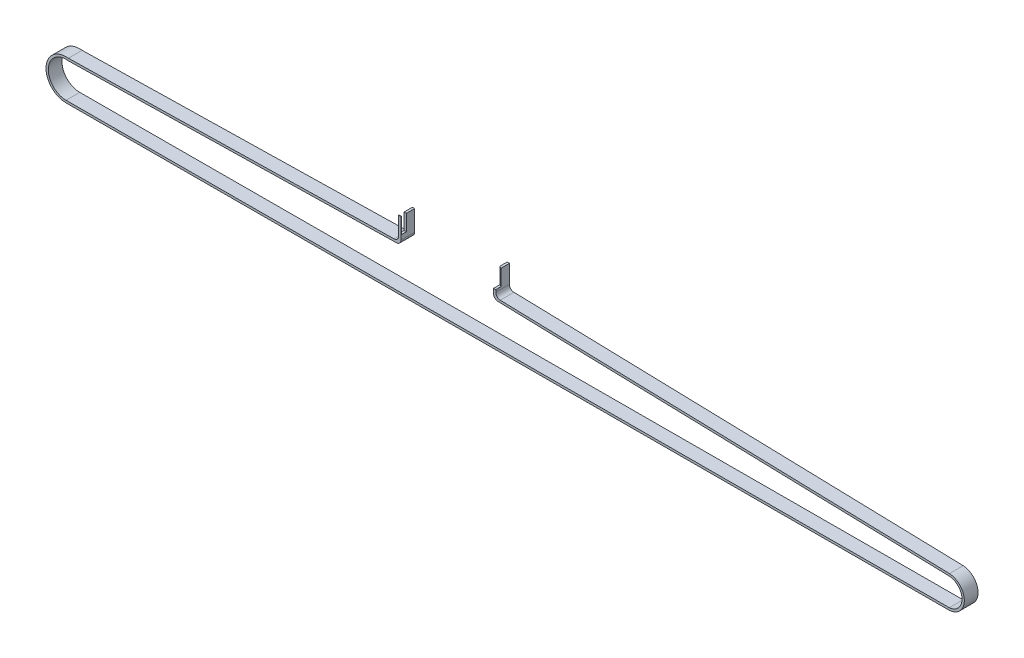
ISO-10303-21;
HEADER;
FILE_DESCRIPTION(('STEP AP214'),'2;1');
FILE_NAME('part.step','',(''),(''),'','','');
FILE_SCHEMA(('AUTOMOTIVE_DESIGN { 1 0 10303 214 1 1 1 1 }'));
ENDSEC;
DATA;
#1=APPLICATION_CONTEXT('core data for automotive mechanical design processes');
#2=APPLICATION_PROTOCOL_DEFINITION('international standard','automotive_design',2000,#1);
#3=PRODUCT_CONTEXT('',#1,'mechanical');
#4=PRODUCT('Part','Part','',(#3));
#5=PRODUCT_RELATED_PRODUCT_CATEGORY('part','',(#4));
#6=PRODUCT_DEFINITION_FORMATION('','',#4);
#7=PRODUCT_DEFINITION_CONTEXT('part definition',#1,'design');
#8=PRODUCT_DEFINITION('design','',#6,#7);
#9=PRODUCT_DEFINITION_SHAPE('','',#8);
#10=(LENGTH_UNIT() NAMED_UNIT(*) SI_UNIT(.MILLI.,.METRE.));
#11=(NAMED_UNIT(*) PLANE_ANGLE_UNIT() SI_UNIT($,.RADIAN.));
#12=(NAMED_UNIT(*) SI_UNIT($,.STERADIAN.) SOLID_ANGLE_UNIT());
#13=UNCERTAINTY_MEASURE_WITH_UNIT(LENGTH_MEASURE(1.E-05),#10,'distance_accuracy_value','');
#14=(GEOMETRIC_REPRESENTATION_CONTEXT(3) GLOBAL_UNCERTAINTY_ASSIGNED_CONTEXT((#13)) GLOBAL_UNIT_ASSIGNED_CONTEXT((#10,
#11,#12)) REPRESENTATION_CONTEXT('',''));
#15=CARTESIAN_POINT('',(0.,0.,0.));
#16=DIRECTION('',(0.,0.,1.));
#17=DIRECTION('',(1.,0.,0.));
#18=AXIS2_PLACEMENT_3D('',#15,#16,#17);
#19=CARTESIAN_POINT('',(-77.6123917073383,-109.1707684477,6.56356693467296));
#20=DIRECTION('',(0.,1.,0.));
#21=DIRECTION('',(0.,0.,1.));
#22=AXIS2_PLACEMENT_3D('',#19,#20,#21);
#23=PLANE('',#22);
#24=CARTESIAN_POINT('',(-76.3043909029961,-109.1707684477,2.20000000000011));
#25=DIRECTION('',(0.,1.,0.));
#26=DIRECTION('',(0.,0.,1.));
#27=AXIS2_PLACEMENT_3D('',#24,#25,#26);
#28=CIRCLE('',#27,2.);
#29=CARTESIAN_POINT('',(-76.6123917073383,-109.1707684477,4.17614156996025));
#30=VERTEX_POINT('',#29);
#31=CARTESIAN_POINT('',(-77.6123917073383,-109.1707684477,3.71298839910964));
#32=VERTEX_POINT('',#31);
#33=EDGE_CURVE('E21',#30,#32,#28,.F.);
#34=ORIENTED_EDGE('',*,*,#33,.F.);
#35=DIRECTION('',(0.,0.,-1.));
#36=VECTOR('',#35,1.);
#37=CARTESIAN_POINT('',(-76.6123917073383,-109.1707684477,6.56356693467296));
#38=LINE('',#37,#36);
#39=CARTESIAN_POINT('',(-76.6123917073383,-109.1707684477,0.563566934672959));
#40=VERTEX_POINT('',#39);
#41=EDGE_CURVE('E187',#40,#30,#38,.F.);
#42=ORIENTED_EDGE('',*,*,#41,.F.);
#43=DIRECTION('',(1.,0.,0.));
#44=VECTOR('',#43,1.);
#45=CARTESIAN_POINT('',(-77.6123917073383,-109.1707684477,0.563566934672959));
#46=LINE('',#45,#44);
#47=CARTESIAN_POINT('',(-77.4542112466602,-109.1707684477,0.563566934672959));
#48=VERTEX_POINT('',#47);
#49=EDGE_CURVE('E194',#40,#48,#46,.F.);
#50=ORIENTED_EDGE('',*,*,#49,.T.);
#51=CARTESIAN_POINT('',(-76.3043909029961,-109.1707684477,2.20000000000011));
#52=DIRECTION('',(0.,1.,0.));
#53=DIRECTION('',(0.,0.,1.));
#54=AXIS2_PLACEMENT_3D('',#51,#52,#53);
#55=CIRCLE('',#54,2.);
#56=CARTESIAN_POINT('',(-77.6123917073383,-109.1707684477,0.687011600890581));
#57=VERTEX_POINT('',#56);
#58=EDGE_CURVE('E208',#57,#48,#55,.F.);
#59=ORIENTED_EDGE('',*,*,#58,.F.);
#60=DIRECTION('',(0.,0.,-1.));
#61=VECTOR('',#60,1.);
#62=CARTESIAN_POINT('',(-77.6123917073383,-109.1707684477,6.56356693467296));
#63=LINE('',#62,#61);
#64=EDGE_CURVE('E190',#57,#32,#63,.F.);
#65=ORIENTED_EDGE('',*,*,#64,.T.);
#66=EDGE_LOOP('',(#34,#42,#50,#59,#65));
#67=FACE_BOUND('',#66,.T.);
#68=ADVANCED_FACE('F18',(#67),#23,.T.);
#69=CARTESIAN_POINT('',(-76.3043909029961,-116.170768447701,2.20000000000011));
#70=DIRECTION('',(0.,1.,0.));
#71=DIRECTION('',(0.,0.,1.));
#72=AXIS2_PLACEMENT_3D('',#69,#70,#71);
#73=CYLINDRICAL_SURFACE('',#72,2.);
#74=CARTESIAN_POINT('',(-76.3043909029961,-116.170768447701,2.20000000000011));
#75=DIRECTION('',(0.,1.,0.));
#76=DIRECTION('',(0.,0.,1.));
#77=AXIS2_PLACEMENT_3D('',#74,#75,#76);
#78=CIRCLE('',#77,2.);
#79=CARTESIAN_POINT('',(-76.6123917073383,-116.170768447701,4.17614156996025));
#80=VERTEX_POINT('',#79);
#81=CARTESIAN_POINT('',(-77.6123917073383,-116.170768447701,3.71298839910964));
#82=VERTEX_POINT('',#81);
#83=EDGE_CURVE('E193',#80,#82,#78,.F.);
#84=ORIENTED_EDGE('',*,*,#83,.F.);
#85=DIRECTION('',(0.,1.,0.));
#86=VECTOR('',#85,1.);
#87=CARTESIAN_POINT('',(-76.6123917073383,-120.096434525264,4.17614156996025));
#88=LINE('',#87,#86);
#89=EDGE_CURVE('E196',#30,#80,#88,.F.);
#90=ORIENTED_EDGE('',*,*,#89,.F.);
#91=ORIENTED_EDGE('',*,*,#33,.T.);
#92=DIRECTION('',(0.,1.,0.));
#93=VECTOR('',#92,1.);
#94=CARTESIAN_POINT('',(-77.6123917073383,-120.096434525264,3.71298839910964));
#95=LINE('',#94,#93);
#96=EDGE_CURVE('E269',#32,#82,#95,.F.);
#97=ORIENTED_EDGE('',*,*,#96,.T.);
#98=EDGE_LOOP('',(#84,#90,#91,#97));
#99=FACE_BOUND('',#98,.T.);
#100=ADVANCED_FACE('F197',(#99),#73,.T.);
#101=CARTESIAN_POINT('',(-76.3043909029961,-116.170768447701,2.20000000000011));
#102=DIRECTION('',(0.,1.,0.));
#103=DIRECTION('',(0.,0.,1.));
#104=AXIS2_PLACEMENT_3D('',#101,#102,#103);
#105=PLANE('',#104);
#106=DIRECTION('',(1.,0.,0.));
#107=VECTOR('',#106,1.);
#108=CARTESIAN_POINT('',(-76.3043909029961,-116.170768447701,6.56356693467296));
#109=LINE('',#108,#107);
#110=CARTESIAN_POINT('',(-77.6123917073383,-116.170768447701,6.56356693467296));
#111=VERTEX_POINT('',#110);
#112=CARTESIAN_POINT('',(-76.6123917073383,-116.170768447701,6.56356693467296));
#113=VERTEX_POINT('',#112);
#114=EDGE_CURVE('E271',#111,#113,#109,.T.);
#115=ORIENTED_EDGE('',*,*,#114,.T.);
#116=DIRECTION('',(0.,0.,-1.));
#117=VECTOR('',#116,1.);
#118=CARTESIAN_POINT('',(-76.6123917073383,-116.170768447701,6.56356693467296));
#119=LINE('',#118,#117);
#120=EDGE_CURVE('E202',#80,#113,#119,.F.);
#121=ORIENTED_EDGE('',*,*,#120,.F.);
#122=ORIENTED_EDGE('',*,*,#83,.T.);
#123=DIRECTION('',(0.,0.,-1.));
#124=VECTOR('',#123,1.);
#125=CARTESIAN_POINT('',(-77.6123917073383,-116.170768447701,6.56356693467296));
#126=LINE('',#125,#124);
#127=EDGE_CURVE('E239',#82,#111,#126,.F.);
#128=ORIENTED_EDGE('',*,*,#127,.T.);
#129=EDGE_LOOP('',(#115,#121,#122,#128));
#130=FACE_BOUND('',#129,.T.);
#131=ADVANCED_FACE('F356',(#130),#105,.T.);
#132=CARTESIAN_POINT('',(-118.921768143894,-116.170768447701,2.20000000000011));
#133=DIRECTION('',(0.,1.,0.));
#134=DIRECTION('',(0.,0.,1.));
#135=AXIS2_PLACEMENT_3D('',#132,#133,#134);
#136=CYLINDRICAL_SURFACE('',#135,4.17693228606131);
#137=CARTESIAN_POINT('',(-118.921768143894,-116.170768447701,2.20000000000011));
#138=DIRECTION('',(0.,1.,0.));
#139=DIRECTION('',(0.,0.,1.));
#140=AXIS2_PLACEMENT_3D('',#137,#138,#139);
#141=CIRCLE('',#140,4.17693228606131);
#142=CARTESIAN_POINT('',(-119.111696821927,-116.170768447701,6.37261194212965));
#143=VERTEX_POINT('',#142);
#144=CARTESIAN_POINT('',(-118.111696821927,-116.170768447701,6.2976270908501));
#145=VERTEX_POINT('',#144);
#146=EDGE_CURVE('E274',#143,#145,#141,.T.);
#147=ORIENTED_EDGE('',*,*,#146,.F.);
#148=DIRECTION('',(0.,1.,0.));
#149=VECTOR('',#148,1.);
#150=CARTESIAN_POINT('',(-119.111696821927,-120.096434525272,6.37261194212965));
#151=LINE('',#150,#149);
#152=CARTESIAN_POINT('',(-119.111696821927,-109.1707684477,6.37261194212965));
#153=VERTEX_POINT('',#152);
#154=EDGE_CURVE('E244',#153,#143,#151,.F.);
#155=ORIENTED_EDGE('',*,*,#154,.F.);
#156=CARTESIAN_POINT('',(-118.921768143894,-109.1707684477,2.20000000000011));
#157=DIRECTION('',(0.,1.,0.));
#158=DIRECTION('',(0.,0.,1.));
#159=AXIS2_PLACEMENT_3D('',#156,#157,#158);
#160=CIRCLE('',#159,4.17693228606131);
#161=CARTESIAN_POINT('',(-118.111696821927,-109.1707684477,6.2976270908501));
#162=VERTEX_POINT('',#161);
#163=EDGE_CURVE('E263',#162,#153,#160,.F.);
#164=ORIENTED_EDGE('',*,*,#163,.F.);
#165=DIRECTION('',(0.,1.,0.));
#166=VECTOR('',#165,1.);
#167=CARTESIAN_POINT('',(-118.111696821927,-120.096434525272,6.2976270908501));
#168=LINE('',#167,#166);
#169=EDGE_CURVE('E258',#162,#145,#168,.F.);
#170=ORIENTED_EDGE('',*,*,#169,.T.);
#171=EDGE_LOOP('',(#147,#155,#164,#170));
#172=FACE_BOUND('',#171,.T.);
#173=ADVANCED_FACE('F745',(#172),#136,.F.);
#174=CARTESIAN_POINT('',(-118.921768143894,-116.170768447701,2.20000000000011));
#175=DIRECTION('',(0.,1.,0.));
#176=DIRECTION('',(0.,0.,1.));
#177=AXIS2_PLACEMENT_3D('',#174,#175,#176);
#178=PLANE('',#177);
#179=DIRECTION('',(0.,0.,1.));
#180=VECTOR('',#179,1.);
#181=CARTESIAN_POINT('',(-119.111696821927,-116.170768447701,6.56356693467296));
#182=LINE('',#181,#180);
#183=CARTESIAN_POINT('',(-119.111696821927,-116.170768447701,4.1909613500169));
#184=VERTEX_POINT('',#183);
#185=EDGE_CURVE('E247',#143,#184,#182,.F.);
#186=ORIENTED_EDGE('',*,*,#185,.F.);
#187=ORIENTED_EDGE('',*,*,#146,.T.);
#188=DIRECTION('',(0.,0.,1.));
#189=VECTOR('',#188,1.);
#190=CARTESIAN_POINT('',(-118.111696821927,-116.170768447701,6.56356693467296));
#191=LINE('',#190,#189);
#192=CARTESIAN_POINT('',(-118.111696821927,-116.170768447701,4.02860177549044));
#193=VERTEX_POINT('',#192);
#194=EDGE_CURVE('E260',#145,#193,#191,.F.);
#195=ORIENTED_EDGE('',*,*,#194,.T.);
#196=CARTESIAN_POINT('',(-118.921768143894,-116.170768447701,2.20000000000011));
#197=DIRECTION('',(0.,1.,0.));
#198=DIRECTION('',(0.,0.,1.));
#199=AXIS2_PLACEMENT_3D('',#196,#197,#198);
#200=CIRCLE('',#199,2.);
#201=EDGE_CURVE('E350',#184,#193,#200,.T.);
#202=ORIENTED_EDGE('',*,*,#201,.F.);
#203=EDGE_LOOP('',(#186,#187,#195,#202));
#204=FACE_BOUND('',#203,.T.);
#205=ADVANCED_FACE('F736',(#204),#178,.T.);
#206=CARTESIAN_POINT('',(-118.921768143894,-116.170768447701,2.20000000000011));
#207=DIRECTION('',(0.,1.,0.));
#208=DIRECTION('',(0.,0.,1.));
#209=AXIS2_PLACEMENT_3D('',#206,#207,#208);
#210=CYLINDRICAL_SURFACE('',#209,2.);
#211=CARTESIAN_POINT('',(-118.921768143894,-109.1707684477,2.20000000000011));
#212=DIRECTION('',(0.,1.,0.));
#213=DIRECTION('',(0.,0.,1.));
#214=AXIS2_PLACEMENT_3D('',#211,#212,#213);
#215=CIRCLE('',#214,2.);
#216=CARTESIAN_POINT('',(-119.111696821927,-109.1707684477,4.1909613500169));
#217=VERTEX_POINT('',#216);
#218=CARTESIAN_POINT('',(-118.111696821927,-109.1707684477,4.02860177549044));
#219=VERTEX_POINT('',#218);
#220=EDGE_CURVE('E253',#217,#219,#215,.T.);
#221=ORIENTED_EDGE('',*,*,#220,.F.);
#222=DIRECTION('',(0.,1.,0.));
#223=VECTOR('',#222,1.);
#224=CARTESIAN_POINT('',(-119.111696821927,-120.096434525272,4.1909613500169));
#225=LINE('',#224,#223);
#226=EDGE_CURVE('E225',#184,#217,#225,.T.);
#227=ORIENTED_EDGE('',*,*,#226,.F.);
#228=ORIENTED_EDGE('',*,*,#201,.T.);
#229=DIRECTION('',(0.,1.,0.));
#230=VECTOR('',#229,1.);
#231=CARTESIAN_POINT('',(-118.111696821927,-120.096434525272,4.02860177549044));
#232=LINE('',#231,#230);
#233=EDGE_CURVE('E232',#193,#219,#232,.T.);
#234=ORIENTED_EDGE('',*,*,#233,.T.);
#235=EDGE_LOOP('',(#221,#227,#228,#234));
#236=FACE_BOUND('',#235,.T.);
#237=ADVANCED_FACE('F727',(#236),#210,.T.);
#238=CARTESIAN_POINT('',(-119.111696821927,-109.1707684477,6.56356693467296));
#239=DIRECTION('',(0.,1.,0.));
#240=DIRECTION('',(0.,0.,1.));
#241=AXIS2_PLACEMENT_3D('',#238,#239,#240);
#242=PLANE('',#241);
#243=DIRECTION('',(0.,0.,1.));
#244=VECTOR('',#243,1.);
#245=CARTESIAN_POINT('',(-118.111696821927,-109.1707684477,6.56356693467296));
#246=LINE('',#245,#244);
#247=CARTESIAN_POINT('',(-118.111696821927,-109.1707684477,0.563566934672959));
#248=VERTEX_POINT('',#247);
#249=EDGE_CURVE('E228',#219,#248,#246,.F.);
#250=ORIENTED_EDGE('',*,*,#249,.T.);
#251=DIRECTION('',(1.,0.,0.));
#252=VECTOR('',#251,1.);
#253=CARTESIAN_POINT('',(-119.111696821927,-109.1707684477,0.563566934672959));
#254=LINE('',#253,#252);
#255=CARTESIAN_POINT('',(-119.111696821927,-109.1707684477,0.563566934672959));
#256=VERTEX_POINT('',#255);
#257=EDGE_CURVE('E203',#248,#256,#254,.F.);
#258=ORIENTED_EDGE('',*,*,#257,.T.);
#259=DIRECTION('',(0.,0.,1.));
#260=VECTOR('',#259,1.);
#261=CARTESIAN_POINT('',(-119.111696821927,-109.1707684477,6.56356693467296));
#262=LINE('',#261,#260);
#263=EDGE_CURVE('E221',#217,#256,#262,.F.);
#264=ORIENTED_EDGE('',*,*,#263,.F.);
#265=ORIENTED_EDGE('',*,*,#220,.T.);
#266=EDGE_LOOP('',(#250,#258,#264,#265));
#267=FACE_BOUND('',#266,.T.);
#268=ADVANCED_FACE('F513',(#267),#242,.T.);
#269=CARTESIAN_POINT('',(-76.6123917073383,-120.096434525264,6.56356693467296));
#270=DIRECTION('',(1.,0.,0.));
#271=DIRECTION('',(0.,0.,-1.));
#272=AXIS2_PLACEMENT_3D('',#269,#270,#271);
#273=PLANE('',#272);
#274=DIRECTION('',(0.,1.,0.));
#275=VECTOR('',#274,1.);
#276=CARTESIAN_POINT('',(-76.6123917073383,-130.657156953866,0.563566934672959));
#277=LINE('',#276,#275);
#278=CARTESIAN_POINT('',(-76.6123917073383,-117.176487603258,0.563566934672959));
#279=VERTEX_POINT('',#278);
#280=EDGE_CURVE('E207',#279,#40,#277,.T.);
#281=ORIENTED_EDGE('',*,*,#280,.T.);
#282=ORIENTED_EDGE('',*,*,#41,.T.);
#283=ORIENTED_EDGE('',*,*,#89,.T.);
#284=ORIENTED_EDGE('',*,*,#120,.T.);
#285=DIRECTION('',(0.,1.,0.));
#286=VECTOR('',#285,1.);
#287=CARTESIAN_POINT('',(-76.6123917073383,-120.096434525264,6.56356693467296));
#288=LINE('',#287,#286);
#289=CARTESIAN_POINT('',(-76.6123917073383,-117.176487603258,6.56356693467296));
#290=VERTEX_POINT('',#289);
#291=EDGE_CURVE('E209',#113,#290,#288,.F.);
#292=ORIENTED_EDGE('',*,*,#291,.T.);
#293=DIRECTION('',(0.,0.,1.));
#294=VECTOR('',#293,1.);
#295=CARTESIAN_POINT('',(-76.6123917073383,-117.176487603258,6.56356693467296));
#296=LINE('',#295,#294);
#297=EDGE_CURVE('E393',#290,#279,#296,.F.);
#298=ORIENTED_EDGE('',*,*,#297,.T.);
#299=EDGE_LOOP('',(#281,#282,#283,#284,#292,#298));
#300=FACE_BOUND('',#299,.T.);
#301=ADVANCED_FACE('F205',(#300),#273,.T.);
#302=CARTESIAN_POINT('',(-76.3043909029961,-116.170768447701,2.20000000000011));
#303=DIRECTION('',(0.,1.,0.));
#304=DIRECTION('',(0.,0.,1.));
#305=AXIS2_PLACEMENT_3D('',#302,#303,#304);
#306=CYLINDRICAL_SURFACE('',#305,2.);
#307=DIRECTION('',(0.,1.,0.));
#308=VECTOR('',#307,1.);
#309=CARTESIAN_POINT('',(-77.4542112466602,-130.657156953866,0.563566934672959));
#310=LINE('',#309,#308);
#311=CARTESIAN_POINT('',(-77.4542112466602,-116.170768447701,0.563566934672959));
#312=VERTEX_POINT('',#311);
#313=EDGE_CURVE('E367',#48,#312,#310,.F.);
#314=ORIENTED_EDGE('',*,*,#313,.T.);
#315=CARTESIAN_POINT('',(-76.3043909029961,-116.170768447701,2.20000000000011));
#316=DIRECTION('',(0.,1.,0.));
#317=DIRECTION('',(0.,0.,1.));
#318=AXIS2_PLACEMENT_3D('',#315,#316,#317);
#319=CIRCLE('',#318,2.);
#320=CARTESIAN_POINT('',(-77.6123917073383,-116.170768447701,0.687011600890581));
#321=VERTEX_POINT('',#320);
#322=EDGE_CURVE('E212',#321,#312,#319,.F.);
#323=ORIENTED_EDGE('',*,*,#322,.F.);
#324=DIRECTION('',(0.,1.,0.));
#325=VECTOR('',#324,1.);
#326=CARTESIAN_POINT('',(-77.6123917073383,-120.096434525264,0.687011600890582));
#327=LINE('',#326,#325);
#328=EDGE_CURVE('E266',#321,#57,#327,.T.);
#329=ORIENTED_EDGE('',*,*,#328,.T.);
#330=ORIENTED_EDGE('',*,*,#58,.T.);
#331=EDGE_LOOP('',(#314,#323,#329,#330));
#332=FACE_BOUND('',#331,.T.);
#333=ADVANCED_FACE('F504',(#332),#306,.T.);
#334=CARTESIAN_POINT('',(-76.3043909029961,-116.170768447701,2.20000000000011));
#335=DIRECTION('',(0.,1.,0.));
#336=DIRECTION('',(0.,0.,1.));
#337=AXIS2_PLACEMENT_3D('',#334,#335,#336);
#338=PLANE('',#337);
#339=ORIENTED_EDGE('',*,*,#322,.T.);
#340=DIRECTION('',(1.,0.,0.));
#341=VECTOR('',#340,1.);
#342=CARTESIAN_POINT('',(-264.648815476265,-116.170768447701,0.563566934672959));
#343=LINE('',#342,#341);
#344=CARTESIAN_POINT('',(-77.6123917073383,-116.170768447701,0.563566934672959));
#345=VERTEX_POINT('',#344);
#346=EDGE_CURVE('E322',#312,#345,#343,.F.);
#347=ORIENTED_EDGE('',*,*,#346,.T.);
#348=DIRECTION('',(0.,0.,-1.));
#349=VECTOR('',#348,1.);
#350=CARTESIAN_POINT('',(-77.6123917073383,-116.170768447701,6.56356693467296));
#351=LINE('',#350,#349);
#352=EDGE_CURVE('E235',#345,#321,#351,.F.);
#353=ORIENTED_EDGE('',*,*,#352,.T.);
#354=EDGE_LOOP('',(#339,#347,#353));
#355=FACE_BOUND('',#354,.T.);
#356=ADVANCED_FACE('F372',(#355),#338,.T.);
#357=CARTESIAN_POINT('',(-77.6123917073383,-120.096434525264,6.56356693467296));
#358=DIRECTION('',(1.,0.,0.));
#359=DIRECTION('',(0.,0.,-1.));
#360=AXIS2_PLACEMENT_3D('',#357,#358,#359);
#361=PLANE('',#360);
#362=DIRECTION('',(0.,1.,0.));
#363=VECTOR('',#362,1.);
#364=CARTESIAN_POINT('',(-77.6123917073383,-130.657156953866,0.563566934672959));
#365=LINE('',#364,#363);
#366=CARTESIAN_POINT('',(-77.6123917073383,-118.149803243927,0.563566934672959));
#367=VERTEX_POINT('',#366);
#368=EDGE_CURVE('E343',#345,#367,#365,.F.);
#369=ORIENTED_EDGE('',*,*,#368,.T.);
#370=DIRECTION('',(0.,0.,-1.));
#371=VECTOR('',#370,1.);
#372=CARTESIAN_POINT('',(-77.6123917073383,-118.149803243927,6.56356693467296));
#373=LINE('',#372,#371);
#374=CARTESIAN_POINT('',(-77.6123917073383,-118.149803243927,6.56356693467296));
#375=VERTEX_POINT('',#374);
#376=EDGE_CURVE('E238',#375,#367,#373,.T.);
#377=ORIENTED_EDGE('',*,*,#376,.F.);
#378=DIRECTION('',(0.,1.,0.));
#379=VECTOR('',#378,1.);
#380=CARTESIAN_POINT('',(-77.6123917073383,-130.657156953866,6.56356693467296));
#381=LINE('',#380,#379);
#382=EDGE_CURVE('E317',#111,#375,#381,.F.);
#383=ORIENTED_EDGE('',*,*,#382,.F.);
#384=ORIENTED_EDGE('',*,*,#127,.F.);
#385=ORIENTED_EDGE('',*,*,#96,.F.);
#386=ORIENTED_EDGE('',*,*,#64,.F.);
#387=ORIENTED_EDGE('',*,*,#328,.F.);
#388=ORIENTED_EDGE('',*,*,#352,.F.);
#389=EDGE_LOOP('',(#369,#377,#383,#384,#385,#386,#387,#388));
#390=FACE_BOUND('',#389,.T.);
#391=ADVANCED_FACE('F359',(#390),#361,.F.);
#392=CARTESIAN_POINT('',(-75.6123917073383,-118.149803243927,6.56356693467296));
#393=DIRECTION('',(0.,0.,-1.));
#394=DIRECTION('',(-1.,0.,0.));
#395=AXIS2_PLACEMENT_3D('',#392,#393,#394);
#396=CYLINDRICAL_SURFACE('',#395,2.);
#397=CARTESIAN_POINT('',(-75.6123917073383,-118.149803243927,0.563566934672959));
#398=DIRECTION('',(0.,0.,-1.));
#399=DIRECTION('',(-1.,0.,0.));
#400=AXIS2_PLACEMENT_3D('',#397,#398,#399);
#401=CIRCLE('',#400,2.);
#402=CARTESIAN_POINT('',(-75.666472220668,-120.149071934743,0.563566934672958));
#403=VERTEX_POINT('',#402);
#404=EDGE_CURVE('E341',#367,#403,#401,.F.);
#405=ORIENTED_EDGE('',*,*,#404,.T.);
#406=DIRECTION('',(0.,0.,1.));
#407=VECTOR('',#406,1.);
#408=CARTESIAN_POINT('',(-75.666472220668,-120.149071934743,6.56356693467296));
#409=LINE('',#408,#407);
#410=CARTESIAN_POINT('',(-75.666472220668,-120.149071934743,6.56356693467296));
#411=VERTEX_POINT('',#410);
#412=EDGE_CURVE('E425',#403,#411,#409,.T.);
#413=ORIENTED_EDGE('',*,*,#412,.T.);
#414=CARTESIAN_POINT('',(-75.6123917073383,-118.149803243927,6.56356693467296));
#415=DIRECTION('',(0.,0.,-1.));
#416=DIRECTION('',(-1.,0.,0.));
#417=AXIS2_PLACEMENT_3D('',#414,#415,#416);
#418=CIRCLE('',#417,2.);
#419=EDGE_CURVE('E314',#375,#411,#418,.F.);
#420=ORIENTED_EDGE('',*,*,#419,.F.);
#421=ORIENTED_EDGE('',*,*,#376,.T.);
#422=EDGE_LOOP('',(#405,#413,#420,#421));
#423=FACE_BOUND('',#422,.T.);
#424=ADVANCED_FACE('F430',(#423),#396,.T.);
#425=CARTESIAN_POINT('',(121.836852943332,-125.491566046838,6.56356693467296));
#426=DIRECTION('',(0.0270402566648223,0.99963434540811,0.));
#427=DIRECTION('',(-0.99963434540811,0.0270402566648223,0.));
#428=AXIS2_PLACEMENT_3D('',#425,#426,#427);
#429=PLANE('',#428);
#430=ORIENTED_EDGE('',*,*,#412,.F.);
#431=DIRECTION('',(0.99963434540811,-0.0270402566648222,0.));
#432=VECTOR('',#431,1.);
#433=CARTESIAN_POINT('',(-75.666472220668,-120.149071934743,0.563566934672959));
#434=LINE('',#433,#432);
#435=CARTESIAN_POINT('',(121.836852943332,-125.491566046838,0.563566934672959));
#436=VERTEX_POINT('',#435);
#437=EDGE_CURVE('E340',#403,#436,#434,.T.);
#438=ORIENTED_EDGE('',*,*,#437,.T.);
#439=DIRECTION('',(0.,0.,-1.));
#440=VECTOR('',#439,1.);
#441=CARTESIAN_POINT('',(121.836852943332,-125.491566046838,6.56356693467296));
#442=LINE('',#441,#440);
#443=CARTESIAN_POINT('',(121.836852943332,-125.491566046838,6.56356693467296));
#444=VERTEX_POINT('',#443);
#445=EDGE_CURVE('E424',#436,#444,#442,.F.);
#446=ORIENTED_EDGE('',*,*,#445,.T.);
#447=DIRECTION('',(0.99963434540811,-0.0270402566648222,0.));
#448=VECTOR('',#447,1.);
#449=CARTESIAN_POINT('',(-75.666472220668,-120.149071934743,6.56356693467296));
#450=LINE('',#449,#448);
#451=EDGE_CURVE('E313',#411,#444,#450,.T.);
#452=ORIENTED_EDGE('',*,*,#451,.F.);
#453=EDGE_LOOP('',(#430,#438,#446,#452));
#454=FACE_BOUND('',#453,.T.);
#455=ADVANCED_FACE('F573',(#454),#429,.F.);
#456=CARTESIAN_POINT('',(121.394517857936,-131.470824001945,6.56356693467296));
#457=DIRECTION('',(0.,0.,-1.));
#458=DIRECTION('',(-1.,0.,0.));
#459=AXIS2_PLACEMENT_3D('',#456,#457,#458);
#460=CYLINDRICAL_SURFACE('',#459,5.99559721975081);
#461=DIRECTION('',(0.,0.,1.));
#462=VECTOR('',#461,1.);
#463=CARTESIAN_POINT('',(121.825156451343,-137.450935741984,6.56356693467296));
#464=LINE('',#463,#462);
#465=CARTESIAN_POINT('',(121.825156451343,-137.450935741984,0.563566934672958));
#466=VERTEX_POINT('',#465);
#467=CARTESIAN_POINT('',(121.825156451343,-137.450935741984,6.56356693467296));
#468=VERTEX_POINT('',#467);
#469=EDGE_CURVE('E422',#466,#468,#464,.T.);
#470=ORIENTED_EDGE('',*,*,#469,.T.);
#471=CARTESIAN_POINT('',(121.394517857936,-131.470824001945,6.56356693467296));
#472=DIRECTION('',(0.,0.,-1.));
#473=DIRECTION('',(-1.,0.,0.));
#474=AXIS2_PLACEMENT_3D('',#471,#472,#473);
#475=CIRCLE('',#474,5.99559721975081);
#476=EDGE_CURVE('E310',#444,#468,#475,.T.);
#477=ORIENTED_EDGE('',*,*,#476,.F.);
#478=ORIENTED_EDGE('',*,*,#445,.F.);
#479=CARTESIAN_POINT('',(121.394517857936,-131.470824001945,0.563566934672959));
#480=DIRECTION('',(0.,0.,-1.));
#481=DIRECTION('',(-1.,0.,0.));
#482=AXIS2_PLACEMENT_3D('',#479,#480,#481);
#483=CIRCLE('',#482,5.99559721975081);
#484=EDGE_CURVE('E338',#436,#466,#483,.T.);
#485=ORIENTED_EDGE('',*,*,#484,.T.);
#486=EDGE_LOOP('',(#470,#477,#478,#485));
#487=FACE_BOUND('',#486,.T.);
#488=ADVANCED_FACE('F570',(#487),#460,.F.);
#489=CARTESIAN_POINT('',(-264.629528335664,-138.412080698056,6.56356693467296));
#490=DIRECTION('',(0.00248707551312212,-0.999996907222913,0.));
#491=DIRECTION('',(0.999996907222913,0.00248707551312212,0.));
#492=AXIS2_PLACEMENT_3D('',#489,#490,#491);
#493=PLANE('',#492);
#494=DIRECTION('',(0.,0.,-1.));
#495=VECTOR('',#494,1.);
#496=CARTESIAN_POINT('',(-264.629528335664,-138.412080698056,6.56356693467296));
#497=LINE('',#496,#495);
#498=CARTESIAN_POINT('',(-264.629528335664,-138.412080698056,0.563566934672959));
#499=VERTEX_POINT('',#498);
#500=CARTESIAN_POINT('',(-264.629528335664,-138.412080698056,6.56356693467296));
#501=VERTEX_POINT('',#500);
#502=EDGE_CURVE('E419',#499,#501,#497,.F.);
#503=ORIENTED_EDGE('',*,*,#502,.T.);
#504=DIRECTION('',(-0.999996907222913,-0.00248707551312205,0.));
#505=VECTOR('',#504,1.);
#506=CARTESIAN_POINT('',(121.825156451343,-137.450935741984,6.56356693467296));
#507=LINE('',#506,#505);
#508=EDGE_CURVE('E309',#468,#501,#507,.T.);
#509=ORIENTED_EDGE('',*,*,#508,.F.);
#510=ORIENTED_EDGE('',*,*,#469,.F.);
#511=DIRECTION('',(-0.999996907222913,-0.00248707551312205,0.));
#512=VECTOR('',#511,1.);
#513=CARTESIAN_POINT('',(121.825156451343,-137.450935741984,0.563566934672959));
#514=LINE('',#513,#512);
#515=EDGE_CURVE('E337',#466,#499,#514,.T.);
#516=ORIENTED_EDGE('',*,*,#515,.T.);
#517=EDGE_LOOP('',(#503,#509,#510,#516));
#518=FACE_BOUND('',#517,.T.);
#519=ADVANCED_FACE('F467',(#518),#493,.F.);
#520=CARTESIAN_POINT('',(-264.648815476265,-130.657156953866,6.56356693467296));
#521=DIRECTION('',(0.,0.,-1.));
#522=DIRECTION('',(-1.,0.,0.));
#523=AXIS2_PLACEMENT_3D('',#520,#521,#522);
#524=CYLINDRICAL_SURFACE('',#523,7.75494772851443);
#525=CARTESIAN_POINT('',(-264.648815476265,-130.657156953866,6.56356693467296));
#526=DIRECTION('',(0.,0.,-1.));
#527=DIRECTION('',(-1.,0.,0.));
#528=AXIS2_PLACEMENT_3D('',#525,#526,#527);
#529=CIRCLE('',#528,7.75494772851443);
#530=CARTESIAN_POINT('',(-263.662284962799,-122.965214948235,6.56356693467296));
#531=VERTEX_POINT('',#530);
#532=EDGE_CURVE('E306',#501,#531,#529,.T.);
#533=ORIENTED_EDGE('',*,*,#532,.F.);
#534=ORIENTED_EDGE('',*,*,#502,.F.);
#535=CARTESIAN_POINT('',(-264.648815476265,-130.657156953866,0.563566934672959));
#536=DIRECTION('',(0.,0.,-1.));
#537=DIRECTION('',(-1.,0.,0.));
#538=AXIS2_PLACEMENT_3D('',#535,#536,#537);
#539=CIRCLE('',#538,7.75494772851443);
#540=CARTESIAN_POINT('',(-263.662284962799,-122.965214948235,0.563566934672958));
#541=VERTEX_POINT('',#540);
#542=EDGE_CURVE('E335',#499,#541,#539,.T.);
#543=ORIENTED_EDGE('',*,*,#542,.T.);
#544=DIRECTION('',(0.,0.,1.));
#545=VECTOR('',#544,1.);
#546=CARTESIAN_POINT('',(-263.662284962799,-122.965214948235,6.56356693467296));
#547=LINE('',#546,#545);
#548=EDGE_CURVE('E417',#541,#531,#547,.T.);
#549=ORIENTED_EDGE('',*,*,#548,.T.);
#550=EDGE_LOOP('',(#533,#534,#543,#549));
#551=FACE_BOUND('',#550,.T.);
#552=ADVANCED_FACE('F472',(#551),#524,.F.);
#553=CARTESIAN_POINT('',(-263.662284962799,-122.965214948235,6.56356693467296));
#554=DIRECTION('',(-0.0197060238129421,0.999805817459312,0.));
#555=DIRECTION('',(-0.999805817459312,-0.0197060238129421,0.));
#556=AXIS2_PLACEMENT_3D('',#553,#554,#555);
#557=PLANE('',#556);
#558=DIRECTION('',(0.,0.,-1.));
#559=VECTOR('',#558,1.);
#560=CARTESIAN_POINT('',(-120.072284774301,-120.135077421925,6.56356693467296));
#561=LINE('',#560,#559);
#562=CARTESIAN_POINT('',(-120.072284774301,-120.135077421925,6.56356693467296));
#563=VERTEX_POINT('',#562);
#564=CARTESIAN_POINT('',(-120.072284774301,-120.135077421925,0.563566934672959));
#565=VERTEX_POINT('',#564);
#566=EDGE_CURVE('E265',#563,#565,#561,.T.);
#567=ORIENTED_EDGE('',*,*,#566,.F.);
#568=DIRECTION('',(0.999805817459312,0.0197060238129421,0.));
#569=VECTOR('',#568,1.);
#570=CARTESIAN_POINT('',(-263.662284962799,-122.965214948235,6.56356693467296));
#571=LINE('',#570,#569);
#572=EDGE_CURVE('E305',#531,#563,#571,.T.);
#573=ORIENTED_EDGE('',*,*,#572,.F.);
#574=ORIENTED_EDGE('',*,*,#548,.F.);
#575=DIRECTION('',(0.999805817459312,0.0197060238129421,0.));
#576=VECTOR('',#575,1.);
#577=CARTESIAN_POINT('',(-263.662284962799,-122.965214948235,0.563566934672959));
#578=LINE('',#577,#576);
#579=EDGE_CURVE('E334',#541,#565,#578,.T.);
#580=ORIENTED_EDGE('',*,*,#579,.T.);
#581=EDGE_LOOP('',(#567,#573,#574,#580));
#582=FACE_BOUND('',#581,.T.);
#583=ADVANCED_FACE('F561',(#582),#557,.F.);
#584=CARTESIAN_POINT('',(-120.111696821927,-118.135465787006,6.56356693467296));
#585=DIRECTION('',(0.,0.,-1.));
#586=DIRECTION('',(-1.,0.,0.));
#587=AXIS2_PLACEMENT_3D('',#584,#585,#586);
#588=CYLINDRICAL_SURFACE('',#587,2.);
#589=CARTESIAN_POINT('',(-120.111696821927,-118.135465787006,0.563566934672959));
#590=DIRECTION('',(0.,0.,-1.));
#591=DIRECTION('',(-1.,0.,0.));
#592=AXIS2_PLACEMENT_3D('',#589,#590,#591);
#593=CIRCLE('',#592,2.);
#594=CARTESIAN_POINT('',(-118.111696821927,-118.135465787006,0.563566934672959));
#595=VERTEX_POINT('',#594);
#596=EDGE_CURVE('E331',#565,#595,#593,.F.);
#597=ORIENTED_EDGE('',*,*,#596,.T.);
#598=DIRECTION('',(0.,0.,1.));
#599=VECTOR('',#598,1.);
#600=CARTESIAN_POINT('',(-118.111696821927,-118.135465787006,6.56356693467296));
#601=LINE('',#600,#599);
#602=CARTESIAN_POINT('',(-118.111696821927,-118.135465787006,6.56356693467296));
#603=VERTEX_POINT('',#602);
#604=EDGE_CURVE('E231',#595,#603,#601,.T.);
#605=ORIENTED_EDGE('',*,*,#604,.T.);
#606=CARTESIAN_POINT('',(-120.111696821927,-118.135465787006,6.56356693467296));
#607=DIRECTION('',(0.,0.,-1.));
#608=DIRECTION('',(-1.,0.,0.));
#609=AXIS2_PLACEMENT_3D('',#606,#607,#608);
#610=CIRCLE('',#609,2.);
#611=EDGE_CURVE('E301',#563,#603,#610,.F.);
#612=ORIENTED_EDGE('',*,*,#611,.F.);
#613=ORIENTED_EDGE('',*,*,#566,.T.);
#614=EDGE_LOOP('',(#597,#605,#612,#613));
#615=FACE_BOUND('',#614,.T.);
#616=ADVANCED_FACE('F557',(#615),#588,.T.);
#617=CARTESIAN_POINT('',(-118.111696821927,-120.096434525272,6.56356693467296));
#618=DIRECTION('',(-1.,0.,0.));
#619=DIRECTION('',(0.,0.,1.));
#620=AXIS2_PLACEMENT_3D('',#617,#618,#619);
#621=PLANE('',#620);
#622=ORIENTED_EDGE('',*,*,#169,.F.);
#623=DIRECTION('',(0.,0.,1.));
#624=VECTOR('',#623,1.);
#625=CARTESIAN_POINT('',(-118.111696821927,-109.1707684477,6.56356693467296));
#626=LINE('',#625,#624);
#627=CARTESIAN_POINT('',(-118.111696821927,-109.1707684477,6.56356693467296));
#628=VERTEX_POINT('',#627);
#629=EDGE_CURVE('E248',#628,#162,#626,.F.);
#630=ORIENTED_EDGE('',*,*,#629,.F.);
#631=DIRECTION('',(0.,1.,0.));
#632=VECTOR('',#631,1.);
#633=CARTESIAN_POINT('',(-118.111696821927,-130.657156953866,6.56356693467296));
#634=LINE('',#633,#632);
#635=EDGE_CURVE('E304',#603,#628,#634,.T.);
#636=ORIENTED_EDGE('',*,*,#635,.F.);
#637=ORIENTED_EDGE('',*,*,#604,.F.);
#638=DIRECTION('',(0.,1.,0.));
#639=VECTOR('',#638,1.);
#640=CARTESIAN_POINT('',(-118.111696821927,-130.657156953866,0.563566934672959));
#641=LINE('',#640,#639);
#642=EDGE_CURVE('E333',#595,#248,#641,.T.);
#643=ORIENTED_EDGE('',*,*,#642,.T.);
#644=ORIENTED_EDGE('',*,*,#249,.F.);
#645=ORIENTED_EDGE('',*,*,#233,.F.);
#646=ORIENTED_EDGE('',*,*,#194,.F.);
#647=EDGE_LOOP('',(#622,#630,#636,#637,#643,#644,#645,#646));
#648=FACE_BOUND('',#647,.T.);
#649=ADVANCED_FACE('F553',(#648),#621,.F.);
#650=CARTESIAN_POINT('',(-119.111696821927,-109.1707684477,6.56356693467296));
#651=DIRECTION('',(0.,1.,0.));
#652=DIRECTION('',(0.,0.,1.));
#653=AXIS2_PLACEMENT_3D('',#650,#651,#652);
#654=PLANE('',#653);
#655=ORIENTED_EDGE('',*,*,#629,.T.);
#656=ORIENTED_EDGE('',*,*,#163,.T.);
#657=DIRECTION('',(0.,0.,1.));
#658=VECTOR('',#657,1.);
#659=CARTESIAN_POINT('',(-119.111696821927,-109.1707684477,6.56356693467296));
#660=LINE('',#659,#658);
#661=CARTESIAN_POINT('',(-119.111696821927,-109.1707684477,6.56356693467296));
#662=VERTEX_POINT('',#661);
#663=EDGE_CURVE('E224',#662,#153,#660,.F.);
#664=ORIENTED_EDGE('',*,*,#663,.F.);
#665=DIRECTION('',(1.,0.,0.));
#666=VECTOR('',#665,1.);
#667=CARTESIAN_POINT('',(-264.648815476265,-109.1707684477,6.56356693467296));
#668=LINE('',#667,#666);
#669=EDGE_CURVE('E405',#628,#662,#668,.F.);
#670=ORIENTED_EDGE('',*,*,#669,.F.);
#671=EDGE_LOOP('',(#655,#656,#664,#670));
#672=FACE_BOUND('',#671,.T.);
#673=ADVANCED_FACE('F549',(#672),#654,.T.);
#674=CARTESIAN_POINT('',(-119.111696821927,-120.096434525272,6.56356693467296));
#675=DIRECTION('',(-1.,0.,0.));
#676=DIRECTION('',(0.,0.,1.));
#677=AXIS2_PLACEMENT_3D('',#674,#675,#676);
#678=PLANE('',#677);
#679=DIRECTION('',(0.,1.,0.));
#680=VECTOR('',#679,1.);
#681=CARTESIAN_POINT('',(-119.111696821927,-130.657156953866,6.56356693467296));
#682=LINE('',#681,#680);
#683=CARTESIAN_POINT('',(-119.111696821927,-117.154981417873,6.56356693467296));
#684=VERTEX_POINT('',#683);
#685=EDGE_CURVE('E300',#662,#684,#682,.F.);
#686=ORIENTED_EDGE('',*,*,#685,.F.);
#687=ORIENTED_EDGE('',*,*,#663,.T.);
#688=ORIENTED_EDGE('',*,*,#154,.T.);
#689=ORIENTED_EDGE('',*,*,#185,.T.);
#690=ORIENTED_EDGE('',*,*,#226,.T.);
#691=ORIENTED_EDGE('',*,*,#263,.T.);
#692=DIRECTION('',(0.,1.,0.));
#693=VECTOR('',#692,1.);
#694=CARTESIAN_POINT('',(-119.111696821927,-130.657156953866,0.563566934672959));
#695=LINE('',#694,#693);
#696=CARTESIAN_POINT('',(-119.111696821927,-117.154981417873,0.563566934672959));
#697=VERTEX_POINT('',#696);
#698=EDGE_CURVE('E330',#256,#697,#695,.F.);
#699=ORIENTED_EDGE('',*,*,#698,.T.);
#700=DIRECTION('',(0.,0.,1.));
#701=VECTOR('',#700,1.);
#702=CARTESIAN_POINT('',(-119.111696821927,-117.154981417873,6.56356693467296));
#703=LINE('',#702,#701);
#704=EDGE_CURVE('E399',#697,#684,#703,.T.);
#705=ORIENTED_EDGE('',*,*,#704,.T.);
#706=EDGE_LOOP('',(#686,#687,#688,#689,#690,#691,#699,#705));
#707=FACE_BOUND('',#706,.T.);
#708=ADVANCED_FACE('F545',(#707),#678,.T.);
#709=CARTESIAN_POINT('',(-121.111696821927,-117.154981417873,6.56356693467296));
#710=DIRECTION('',(0.,0.,1.));
#711=DIRECTION('',(1.,0.,0.));
#712=AXIS2_PLACEMENT_3D('',#709,#710,#711);
#713=CYLINDRICAL_SURFACE('',#712,2.);
#714=ORIENTED_EDGE('',*,*,#704,.F.);
#715=CARTESIAN_POINT('',(-121.111696821927,-117.154981417873,0.563566934672959));
#716=DIRECTION('',(0.,0.,1.));
#717=DIRECTION('',(1.,0.,0.));
#718=AXIS2_PLACEMENT_3D('',#715,#716,#717);
#719=CIRCLE('',#718,2.);
#720=CARTESIAN_POINT('',(-121.072284774301,-119.154593052792,0.563566934672959));
#721=VERTEX_POINT('',#720);
#722=EDGE_CURVE('E327',#697,#721,#719,.F.);
#723=ORIENTED_EDGE('',*,*,#722,.T.);
#724=DIRECTION('',(0.,0.,1.));
#725=VECTOR('',#724,1.);
#726=CARTESIAN_POINT('',(-121.072284774301,-119.154593052792,6.56356693467296));
#727=LINE('',#726,#725);
#728=CARTESIAN_POINT('',(-121.072284774301,-119.154593052792,6.56356693467296));
#729=VERTEX_POINT('',#728);
#730=EDGE_CURVE('E395',#729,#721,#727,.F.);
#731=ORIENTED_EDGE('',*,*,#730,.F.);
#732=CARTESIAN_POINT('',(-121.111696821927,-117.154981417873,6.56356693467296));
#733=DIRECTION('',(0.,0.,1.));
#734=DIRECTION('',(1.,0.,0.));
#735=AXIS2_PLACEMENT_3D('',#732,#733,#734);
#736=CIRCLE('',#735,2.);
#737=EDGE_CURVE('E297',#684,#729,#736,.F.);
#738=ORIENTED_EDGE('',*,*,#737,.F.);
#739=EDGE_LOOP('',(#714,#723,#731,#738));
#740=FACE_BOUND('',#739,.T.);
#741=ADVANCED_FACE('F541',(#740),#713,.F.);
#742=CARTESIAN_POINT('',(-263.681990986612,-121.965409130776,6.56356693467296));
#743=DIRECTION('',(-0.0197060238129421,0.999805817459312,0.));
#744=DIRECTION('',(-0.999805817459312,-0.0197060238129421,0.));
#745=AXIS2_PLACEMENT_3D('',#742,#743,#744);
#746=PLANE('',#745);
#747=DIRECTION('',(-0.999805817459312,-0.0197060238129421,0.));
#748=VECTOR('',#747,1.);
#749=CARTESIAN_POINT('',(-121.072284774301,-119.154593052792,0.563566934672959));
#750=LINE('',#749,#748);
#751=CARTESIAN_POINT('',(-263.610486022413,-121.963999778577,0.563566934672959));
#752=VERTEX_POINT('',#751);
#753=EDGE_CURVE('E329',#721,#752,#750,.T.);
#754=ORIENTED_EDGE('',*,*,#753,.T.);
#755=DIRECTION('',(0.,0.,-1.));
#756=VECTOR('',#755,1.);
#757=CARTESIAN_POINT('',(-263.610486022413,-121.963999778577,6.56356693467296));
#758=LINE('',#757,#756);
#759=CARTESIAN_POINT('',(-263.610486022413,-121.963999778577,6.56356693467296));
#760=VERTEX_POINT('',#759);
#761=EDGE_CURVE('E382',#760,#752,#758,.T.);
#762=ORIENTED_EDGE('',*,*,#761,.F.);
#763=DIRECTION('',(-0.999805817459312,-0.0197060238129421,0.));
#764=VECTOR('',#763,1.);
#765=CARTESIAN_POINT('',(-121.072284774301,-119.154593052792,6.56356693467296));
#766=LINE('',#765,#764);
#767=EDGE_CURVE('E296',#729,#760,#766,.T.);
#768=ORIENTED_EDGE('',*,*,#767,.F.);
#769=ORIENTED_EDGE('',*,*,#730,.T.);
#770=EDGE_LOOP('',(#754,#762,#768,#769));
#771=FACE_BOUND('',#770,.T.);
#772=ADVANCED_FACE('F538',(#771),#746,.T.);
#773=CARTESIAN_POINT('',(121.863893199997,-124.49193170143,6.56356693467296));
#774=DIRECTION('',(0.0270402566648223,0.99963434540811,0.));
#775=DIRECTION('',(-0.99963434540811,0.0270402566648223,0.));
#776=AXIS2_PLACEMENT_3D('',#773,#774,#775);
#777=PLANE('',#776);
#778=DIRECTION('',(-0.99963434540811,0.0270402566648223,0.));
#779=VECTOR('',#778,1.);
#780=CARTESIAN_POINT('',(121.886386765451,-124.492540155697,6.56356693467296));
#781=LINE('',#780,#779);
#782=CARTESIAN_POINT('',(121.886386765452,-124.492540155697,6.56356693467296));
#783=VERTEX_POINT('',#782);
#784=CARTESIAN_POINT('',(-74.666472220668,-119.175756294075,6.56356693467296));
#785=VERTEX_POINT('',#784);
#786=EDGE_CURVE('E292',#783,#785,#781,.T.);
#787=ORIENTED_EDGE('',*,*,#786,.F.);
#788=DIRECTION('',(0.,0.,-1.));
#789=VECTOR('',#788,1.);
#790=CARTESIAN_POINT('',(121.886386765451,-124.492540155697,6.56356693467296));
#791=LINE('',#790,#789);
#792=CARTESIAN_POINT('',(121.886386765452,-124.492540155697,0.563566934672959));
#793=VERTEX_POINT('',#792);
#794=EDGE_CURVE('E321',#793,#783,#791,.F.);
#795=ORIENTED_EDGE('',*,*,#794,.F.);
#796=DIRECTION('',(-0.99963434540811,0.0270402566648223,0.));
#797=VECTOR('',#796,1.);
#798=CARTESIAN_POINT('',(121.886386765451,-124.492540155697,0.563566934672959));
#799=LINE('',#798,#797);
#800=CARTESIAN_POINT('',(-74.666472220668,-119.175756294075,0.563566934672959));
#801=VERTEX_POINT('',#800);
#802=EDGE_CURVE('E326',#793,#801,#799,.T.);
#803=ORIENTED_EDGE('',*,*,#802,.T.);
#804=DIRECTION('',(0.,0.,1.));
#805=VECTOR('',#804,1.);
#806=CARTESIAN_POINT('',(-74.666472220668,-119.175756294075,6.56356693467296));
#807=LINE('',#806,#805);
#808=EDGE_CURVE('E385',#801,#785,#807,.T.);
#809=ORIENTED_EDGE('',*,*,#808,.T.);
#810=EDGE_LOOP('',(#787,#795,#803,#809));
#811=FACE_BOUND('',#810,.T.);
#812=ADVANCED_FACE('F492',(#811),#777,.T.);
#813=CARTESIAN_POINT('',(-74.6123917073383,-117.176487603258,6.56356693467296));
#814=DIRECTION('',(0.,0.,1.));
#815=DIRECTION('',(1.,0.,0.));
#816=AXIS2_PLACEMENT_3D('',#813,#814,#815);
#817=CYLINDRICAL_SURFACE('',#816,2.);
#818=ORIENTED_EDGE('',*,*,#808,.F.);
#819=CARTESIAN_POINT('',(-74.6123917073383,-117.176487603258,0.563566934672959));
#820=DIRECTION('',(0.,0.,1.));
#821=DIRECTION('',(1.,0.,0.));
#822=AXIS2_PLACEMENT_3D('',#819,#820,#821);
#823=CIRCLE('',#822,2.);
#824=EDGE_CURVE('E323',#801,#279,#823,.F.);
#825=ORIENTED_EDGE('',*,*,#824,.T.);
#826=ORIENTED_EDGE('',*,*,#297,.F.);
#827=CARTESIAN_POINT('',(-74.6123917073383,-117.176487603258,6.56356693467296));
#828=DIRECTION('',(0.,0.,1.));
#829=DIRECTION('',(1.,0.,0.));
#830=AXIS2_PLACEMENT_3D('',#827,#828,#829);
#831=CIRCLE('',#830,2.);
#832=EDGE_CURVE('E289',#785,#290,#831,.F.);
#833=ORIENTED_EDGE('',*,*,#832,.F.);
#834=EDGE_LOOP('',(#818,#825,#826,#833));
#835=FACE_BOUND('',#834,.T.);
#836=ADVANCED_FACE('F497',(#835),#817,.F.);
#837=CARTESIAN_POINT('',(-264.648815476265,-130.657156953866,0.563566934672959));
#838=DIRECTION('',(0.,0.,1.));
#839=DIRECTION('',(1.,0.,0.));
#840=AXIS2_PLACEMENT_3D('',#837,#838,#839);
#841=PLANE('',#840);
#842=ORIENTED_EDGE('',*,*,#313,.F.);
#843=ORIENTED_EDGE('',*,*,#49,.F.);
#844=ORIENTED_EDGE('',*,*,#280,.F.);
#845=ORIENTED_EDGE('',*,*,#824,.F.);
#846=ORIENTED_EDGE('',*,*,#802,.F.);
#847=CARTESIAN_POINT('',(121.394517857936,-131.470824001945,0.563566934672959));
#848=DIRECTION('',(0.,0.,-1.));
#849=DIRECTION('',(-1.,0.,0.));
#850=AXIS2_PLACEMENT_3D('',#847,#848,#849);
#851=CIRCLE('',#850,6.99559721975081);
#852=CARTESIAN_POINT('',(121.861018125891,-138.450849643802,0.563566934672957));
#853=VERTEX_POINT('',#852);
#854=EDGE_CURVE('E318',#853,#793,#851,.F.);
#855=ORIENTED_EDGE('',*,*,#854,.F.);
#856=DIRECTION('',(0.999996907222913,0.00248707551312212,0.));
#857=VECTOR('',#856,1.);
#858=CARTESIAN_POINT('',(-264.627041260151,-139.412077605279,0.563566934672955));
#859=LINE('',#858,#857);
#860=CARTESIAN_POINT('',(-264.627041260151,-139.412077605279,0.563566934672956));
#861=VERTEX_POINT('',#860);
#862=EDGE_CURVE('E287',#861,#853,#859,.T.);
#863=ORIENTED_EDGE('',*,*,#862,.F.);
#864=CARTESIAN_POINT('',(-264.648815476265,-130.657156953866,0.563566934672959));
#865=DIRECTION('',(0.,0.,-1.));
#866=DIRECTION('',(-1.,0.,0.));
#867=AXIS2_PLACEMENT_3D('',#864,#865,#866);
#868=CIRCLE('',#867,8.75494772851443);
#869=EDGE_CURVE('E284',#752,#861,#868,.F.);
#870=ORIENTED_EDGE('',*,*,#869,.F.);
#871=ORIENTED_EDGE('',*,*,#753,.F.);
#872=ORIENTED_EDGE('',*,*,#722,.F.);
#873=ORIENTED_EDGE('',*,*,#698,.F.);
#874=ORIENTED_EDGE('',*,*,#257,.F.);
#875=ORIENTED_EDGE('',*,*,#642,.F.);
#876=ORIENTED_EDGE('',*,*,#596,.F.);
#877=ORIENTED_EDGE('',*,*,#579,.F.);
#878=ORIENTED_EDGE('',*,*,#542,.F.);
#879=ORIENTED_EDGE('',*,*,#515,.F.);
#880=ORIENTED_EDGE('',*,*,#484,.F.);
#881=ORIENTED_EDGE('',*,*,#437,.F.);
#882=ORIENTED_EDGE('',*,*,#404,.F.);
#883=ORIENTED_EDGE('',*,*,#368,.F.);
#884=ORIENTED_EDGE('',*,*,#346,.F.);
#885=EDGE_LOOP('',(#842,#843,#844,#845,#846,#855,#863,#870,#871,#872,#873,#874,#875,#876,#877,
#878,#879,#880,#881,#882,#883,#884));
#886=FACE_BOUND('',#885,.T.);
#887=ADVANCED_FACE('F379',(#886),#841,.F.);
#888=CARTESIAN_POINT('',(121.394517857936,-131.470824001945,6.56356693467296));
#889=DIRECTION('',(0.,0.,-1.));
#890=DIRECTION('',(-1.,0.,0.));
#891=AXIS2_PLACEMENT_3D('',#888,#889,#890);
#892=CYLINDRICAL_SURFACE('',#891,6.99559721975081);
#893=CARTESIAN_POINT('',(121.394517857936,-131.470824001945,6.56356693467296));
#894=DIRECTION('',(0.,0.,-1.));
#895=DIRECTION('',(-1.,0.,0.));
#896=AXIS2_PLACEMENT_3D('',#893,#894,#895);
#897=CIRCLE('',#896,6.99559721975081);
#898=CARTESIAN_POINT('',(121.861018125891,-138.450849643802,6.56356693467296));
#899=VERTEX_POINT('',#898);
#900=EDGE_CURVE('E293',#899,#783,#897,.F.);
#901=ORIENTED_EDGE('',*,*,#900,.F.);
#902=DIRECTION('',(0.,0.,1.));
#903=VECTOR('',#902,1.);
#904=CARTESIAN_POINT('',(121.861018125891,-138.450849643802,6.56356693467296));
#905=LINE('',#904,#903);
#906=EDGE_CURVE('E442',#853,#899,#905,.T.);
#907=ORIENTED_EDGE('',*,*,#906,.F.);
#908=ORIENTED_EDGE('',*,*,#854,.T.);
#909=ORIENTED_EDGE('',*,*,#794,.T.);
#910=EDGE_LOOP('',(#901,#907,#908,#909));
#911=FACE_BOUND('',#910,.T.);
#912=ADVANCED_FACE('F528',(#911),#892,.T.);
#913=CARTESIAN_POINT('',(-264.648815476265,-130.657156953866,6.56356693467296));
#914=DIRECTION('',(0.,0.,1.));
#915=DIRECTION('',(1.,0.,0.));
#916=AXIS2_PLACEMENT_3D('',#913,#914,#915);
#917=PLANE('',#916);
#918=ORIENTED_EDGE('',*,*,#786,.T.);
#919=ORIENTED_EDGE('',*,*,#832,.T.);
#920=ORIENTED_EDGE('',*,*,#291,.F.);
#921=ORIENTED_EDGE('',*,*,#114,.F.);
#922=ORIENTED_EDGE('',*,*,#382,.T.);
#923=ORIENTED_EDGE('',*,*,#419,.T.);
#924=ORIENTED_EDGE('',*,*,#451,.T.);
#925=ORIENTED_EDGE('',*,*,#476,.T.);
#926=ORIENTED_EDGE('',*,*,#508,.T.);
#927=ORIENTED_EDGE('',*,*,#532,.T.);
#928=ORIENTED_EDGE('',*,*,#572,.T.);
#929=ORIENTED_EDGE('',*,*,#611,.T.);
#930=ORIENTED_EDGE('',*,*,#635,.T.);
#931=ORIENTED_EDGE('',*,*,#669,.T.);
#932=ORIENTED_EDGE('',*,*,#685,.T.);
#933=ORIENTED_EDGE('',*,*,#737,.T.);
#934=ORIENTED_EDGE('',*,*,#767,.T.);
#935=CARTESIAN_POINT('',(-264.648815476265,-130.657156953866,6.56356693467296));
#936=DIRECTION('',(0.,0.,-1.));
#937=DIRECTION('',(-1.,0.,0.));
#938=AXIS2_PLACEMENT_3D('',#935,#936,#937);
#939=CIRCLE('',#938,8.75494772851443);
#940=CARTESIAN_POINT('',(-264.627041260151,-139.412077605279,6.56356693467296));
#941=VERTEX_POINT('',#940);
#942=EDGE_CURVE('E36',#941,#760,#939,.T.);
#943=ORIENTED_EDGE('',*,*,#942,.F.);
#944=DIRECTION('',(0.999996907222913,0.00248707551312212,0.));
#945=VECTOR('',#944,1.);
#946=CARTESIAN_POINT('',(-264.627041260151,-139.412077605279,6.56356693467296));
#947=LINE('',#946,#945);
#948=EDGE_CURVE('E27',#899,#941,#947,.F.);
#949=ORIENTED_EDGE('',*,*,#948,.F.);
#950=ORIENTED_EDGE('',*,*,#900,.T.);
#951=EDGE_LOOP('',(#918,#919,#920,#921,#922,#923,#924,#925,#926,#927,#928,#929,#930,#931,#932,
#933,#934,#943,#949,#950));
#952=FACE_BOUND('',#951,.T.);
#953=ADVANCED_FACE('F434',(#952),#917,.T.);
#954=CARTESIAN_POINT('',(-264.648815476265,-130.657156953866,6.56356693467296));
#955=DIRECTION('',(0.,0.,-1.));
#956=DIRECTION('',(-1.,0.,0.));
#957=AXIS2_PLACEMENT_3D('',#954,#955,#956);
#958=CYLINDRICAL_SURFACE('',#957,8.75494772851443);
#959=ORIENTED_EDGE('',*,*,#869,.T.);
#960=DIRECTION('',(0.,0.,1.));
#961=VECTOR('',#960,1.);
#962=CARTESIAN_POINT('',(-264.627041260151,-139.412077605279,6.56356693467296));
#963=LINE('',#962,#961);
#964=EDGE_CURVE('E11',#941,#861,#963,.F.);
#965=ORIENTED_EDGE('',*,*,#964,.F.);
#966=ORIENTED_EDGE('',*,*,#942,.T.);
#967=ORIENTED_EDGE('',*,*,#761,.T.);
#968=EDGE_LOOP('',(#959,#965,#966,#967));
#969=FACE_BOUND('',#968,.T.);
#970=ADVANCED_FACE('F517',(#969),#958,.T.);
#971=CARTESIAN_POINT('',(-264.627041260151,-139.412077605279,6.56356693467296));
#972=DIRECTION('',(0.00248707551312212,-0.999996907222913,0.));
#973=DIRECTION('',(0.999996907222913,0.00248707551312212,0.));
#974=AXIS2_PLACEMENT_3D('',#971,#972,#973);
#975=PLANE('',#974);
#976=ORIENTED_EDGE('',*,*,#948,.T.);
#977=ORIENTED_EDGE('',*,*,#964,.T.);
#978=ORIENTED_EDGE('',*,*,#862,.T.);
#979=ORIENTED_EDGE('',*,*,#906,.T.);
#980=EDGE_LOOP('',(#976,#977,#978,#979));
#981=FACE_BOUND('',#980,.T.);
#982=ADVANCED_FACE('F515',(#981),#975,.T.);
#983=CLOSED_SHELL('',(#68,#100,#131,#173,#205,#237,#268,#301,#333,#356,#391,#424,#455,#488,#519,
#552,#583,#616,#649,#673,#708,#741,#772,#812,#836,#887,#912,#953,#970,#982));
#984=MANIFOLD_SOLID_BREP('B1',#983);
#985=ADVANCED_BREP_SHAPE_REPRESENTATION('',(#18,#984),#14);
#986=SHAPE_DEFINITION_REPRESENTATION(#9,#985);
ENDSEC;
END-ISO-10303-21;
